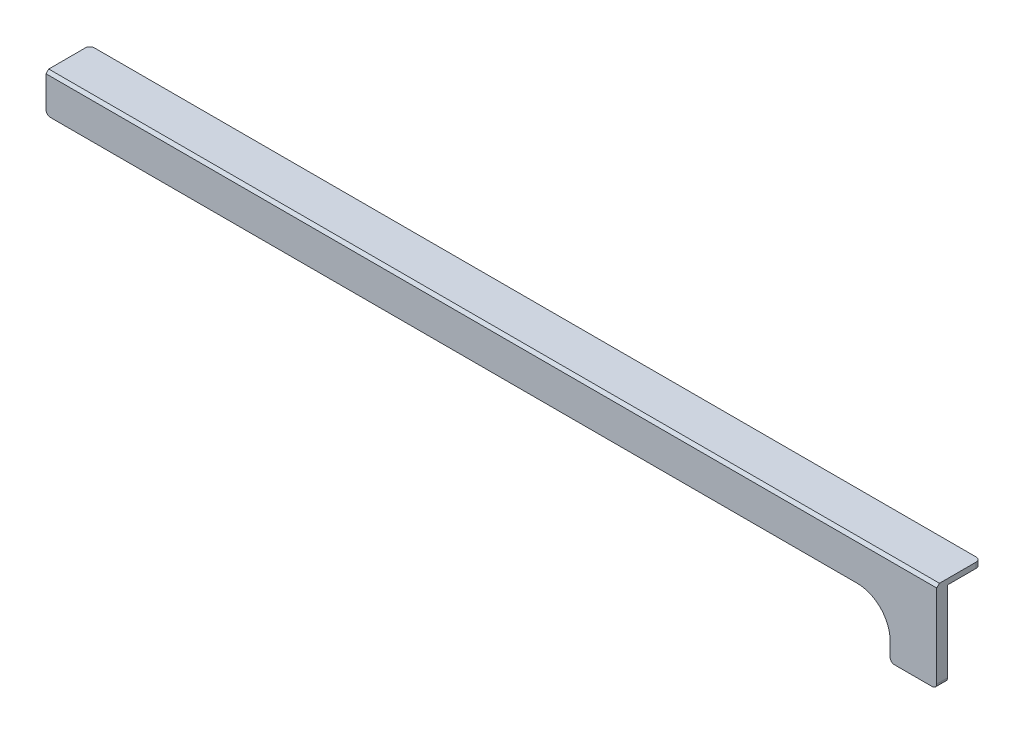
ISO-10303-21;
HEADER;
FILE_DESCRIPTION(('STEP AP214'),'2;1');
FILE_NAME('part.step','',(''),(''),'','','');
FILE_SCHEMA(('AUTOMOTIVE_DESIGN { 1 0 10303 214 1 1 1 1 }'));
ENDSEC;
DATA;
#1=APPLICATION_CONTEXT('core data for automotive mechanical design processes');
#2=APPLICATION_PROTOCOL_DEFINITION('international standard','automotive_design',2000,#1);
#3=PRODUCT_CONTEXT('',#1,'mechanical');
#4=PRODUCT('Part','Part','',(#3));
#5=PRODUCT_RELATED_PRODUCT_CATEGORY('part','',(#4));
#6=PRODUCT_DEFINITION_FORMATION('','',#4);
#7=PRODUCT_DEFINITION_CONTEXT('part definition',#1,'design');
#8=PRODUCT_DEFINITION('design','',#6,#7);
#9=PRODUCT_DEFINITION_SHAPE('','',#8);
#10=(LENGTH_UNIT() NAMED_UNIT(*) SI_UNIT(.MILLI.,.METRE.));
#11=(NAMED_UNIT(*) PLANE_ANGLE_UNIT() SI_UNIT($,.RADIAN.));
#12=(NAMED_UNIT(*) SI_UNIT($,.STERADIAN.) SOLID_ANGLE_UNIT());
#13=UNCERTAINTY_MEASURE_WITH_UNIT(LENGTH_MEASURE(1.E-05),#10,'distance_accuracy_value','');
#14=(GEOMETRIC_REPRESENTATION_CONTEXT(3) GLOBAL_UNCERTAINTY_ASSIGNED_CONTEXT((#13)) GLOBAL_UNIT_ASSIGNED_CONTEXT((#10,
#11,#12)) REPRESENTATION_CONTEXT('',''));
#15=CARTESIAN_POINT('',(0.,0.,0.));
#16=DIRECTION('',(0.,0.,1.));
#17=DIRECTION('',(1.,0.,0.));
#18=AXIS2_PLACEMENT_3D('',#15,#16,#17);
#19=CARTESIAN_POINT('',(0.,0.,10.1038));
#20=DIRECTION('',(0.,0.,-1.));
#21=DIRECTION('',(-1.,0.,0.));
#22=AXIS2_PLACEMENT_3D('',#19,#20,#21);
#23=PLANE('',#22);
#24=CARTESIAN_POINT('',(72.1349700000001,67.1241265,10.1038));
#25=DIRECTION('',(0.,0.,-1.));
#26=DIRECTION('',(-1.,0.,0.));
#27=AXIS2_PLACEMENT_3D('',#24,#25,#26);
#28=CIRCLE('',#27,1.44999999999999);
#29=CARTESIAN_POINT('',(70.6849700000001,67.1241265,10.1038));
#30=VERTEX_POINT('',#29);
#31=EDGE_CURVE('E46',#30,#30,#28,.T.);
#32=ORIENTED_EDGE('',*,*,#31,.F.);
#33=EDGE_LOOP('',(#32));
#34=FACE_BOUND('',#33,.T.);
#35=CARTESIAN_POINT('',(-65.7847699999999,67.1241265,10.1038));
#36=DIRECTION('',(0.,0.,-1.));
#37=DIRECTION('',(-1.,0.,0.));
#38=AXIS2_PLACEMENT_3D('',#35,#36,#37);
#39=CIRCLE('',#38,1.44999999999999);
#40=CARTESIAN_POINT('',(-67.2347699999999,67.1241265,10.1038));
#41=VERTEX_POINT('',#40);
#42=EDGE_CURVE('E181',#41,#41,#39,.T.);
#43=ORIENTED_EDGE('',*,*,#42,.F.);
#44=EDGE_LOOP('',(#43));
#45=FACE_BOUND('',#44,.T.);
#46=CARTESIAN_POINT('',(106.614905,66.623653,10.1038));
#47=DIRECTION('',(0.,0.,-1.));
#48=DIRECTION('',(-1.,0.,0.));
#49=AXIS2_PLACEMENT_3D('',#46,#47,#48);
#50=CIRCLE('',#49,1.25);
#51=CARTESIAN_POINT('',(105.364905,66.623653,10.1038));
#52=VERTEX_POINT('',#51);
#53=EDGE_CURVE('E185',#52,#52,#50,.T.);
#54=ORIENTED_EDGE('',*,*,#53,.F.);
#55=EDGE_LOOP('',(#54));
#56=FACE_BOUND('',#55,.T.);
#57=CARTESIAN_POINT('',(37.6550350000001,66.623653,10.1038));
#58=DIRECTION('',(0.,0.,-1.));
#59=DIRECTION('',(-1.,0.,0.));
#60=AXIS2_PLACEMENT_3D('',#57,#58,#59);
#61=CIRCLE('',#60,1.25);
#62=CARTESIAN_POINT('',(36.4050350000001,66.623653,10.1038));
#63=VERTEX_POINT('',#62);
#64=EDGE_CURVE('E189',#63,#63,#61,.T.);
#65=ORIENTED_EDGE('',*,*,#64,.F.);
#66=EDGE_LOOP('',(#65));
#67=FACE_BOUND('',#66,.T.);
#68=CARTESIAN_POINT('',(-31.3048349999999,66.623653,10.1038));
#69=DIRECTION('',(0.,0.,-1.));
#70=DIRECTION('',(-1.,0.,0.));
#71=AXIS2_PLACEMENT_3D('',#68,#69,#70);
#72=CIRCLE('',#71,1.25);
#73=CARTESIAN_POINT('',(-32.5548349999999,66.623653,10.1038));
#74=VERTEX_POINT('',#73);
#75=EDGE_CURVE('E193',#74,#74,#72,.T.);
#76=ORIENTED_EDGE('',*,*,#75,.F.);
#77=EDGE_LOOP('',(#76));
#78=FACE_BOUND('',#77,.T.);
#79=CARTESIAN_POINT('',(-100.264705,66.623653,10.1038));
#80=DIRECTION('',(0.,0.,-1.));
#81=DIRECTION('',(-1.,0.,0.));
#82=AXIS2_PLACEMENT_3D('',#79,#80,#81);
#83=CIRCLE('',#82,1.25);
#84=CARTESIAN_POINT('',(-101.514705,66.623653,10.1038));
#85=VERTEX_POINT('',#84);
#86=EDGE_CURVE('E197',#85,#85,#83,.T.);
#87=ORIENTED_EDGE('',*,*,#86,.F.);
#88=EDGE_LOOP('',(#87));
#89=FACE_BOUND('',#88,.T.);
#90=DIRECTION('',(0.,1.,0.));
#91=VECTOR('',#90,1.);
#92=CARTESIAN_POINT('',(165.574775,59.6246,10.1038));
#93=LINE('',#92,#91);
#94=CARTESIAN_POINT('',(165.574775,42.2744,10.1038));
#95=VERTEX_POINT('',#94);
#96=CARTESIAN_POINT('',(165.574775,71.6246,10.1038));
#97=VERTEX_POINT('',#96);
#98=EDGE_CURVE('E213',#95,#97,#93,.T.);
#99=ORIENTED_EDGE('',*,*,#98,.F.);
#100=CARTESIAN_POINT('',(163.974775,42.2744,10.1038));
#101=DIRECTION('',(0.,0.,-1.));
#102=DIRECTION('',(-1.,0.,0.));
#103=AXIS2_PLACEMENT_3D('',#100,#101,#102);
#104=CIRCLE('',#103,1.6);
#105=CARTESIAN_POINT('',(163.974775,40.6744,10.1038));
#106=VERTEX_POINT('',#105);
#107=EDGE_CURVE('E274',#95,#106,#104,.T.);
#108=ORIENTED_EDGE('',*,*,#107,.T.);
#109=DIRECTION('',(1.,0.,0.));
#110=VECTOR('',#109,1.);
#111=CARTESIAN_POINT('',(165.574775,40.6744,10.1038));
#112=LINE('',#111,#110);
#113=CARTESIAN_POINT('',(150.175775,40.6744,10.1038));
#114=VERTEX_POINT('',#113);
#115=EDGE_CURVE('E224',#114,#106,#112,.T.);
#116=ORIENTED_EDGE('',*,*,#115,.F.);
#117=CARTESIAN_POINT('',(150.175775,42.2744,10.1038));
#118=DIRECTION('',(0.,0.,-1.));
#119=DIRECTION('',(-1.,0.,0.));
#120=AXIS2_PLACEMENT_3D('',#117,#118,#119);
#121=CIRCLE('',#120,1.6);
#122=CARTESIAN_POINT('',(148.575775,42.2744,10.1038));
#123=VERTEX_POINT('',#122);
#124=EDGE_CURVE('E271',#114,#123,#121,.T.);
#125=ORIENTED_EDGE('',*,*,#124,.T.);
#126=DIRECTION('',(0.,-1.,0.));
#127=VECTOR('',#126,1.);
#128=CARTESIAN_POINT('',(148.575775,40.6744,10.1038));
#129=LINE('',#128,#127);
#130=CARTESIAN_POINT('',(148.575775,47.6246,10.1038));
#131=VERTEX_POINT('',#130);
#132=EDGE_CURVE('E222',#131,#123,#129,.T.);
#133=ORIENTED_EDGE('',*,*,#132,.F.);
#134=CARTESIAN_POINT('',(136.575775,47.6246,10.1038));
#135=DIRECTION('',(0.,0.,-1.));
#136=DIRECTION('',(-1.,0.,0.));
#137=AXIS2_PLACEMENT_3D('',#134,#135,#136);
#138=CIRCLE('',#137,12.);
#139=CARTESIAN_POINT('',(136.575775,59.6246,10.1038));
#140=VERTEX_POINT('',#139);
#141=EDGE_CURVE('E13',#131,#140,#138,.F.);
#142=ORIENTED_EDGE('',*,*,#141,.T.);
#143=DIRECTION('',(1.,0.,0.));
#144=VECTOR('',#143,1.);
#145=CARTESIAN_POINT('',(148.575775,59.6246,10.1038));
#146=LINE('',#145,#144);
#147=CARTESIAN_POINT('',(-157.624575,59.6246,10.1038));
#148=VERTEX_POINT('',#147);
#149=EDGE_CURVE('E219',#148,#140,#146,.T.);
#150=ORIENTED_EDGE('',*,*,#149,.F.);
#151=CARTESIAN_POINT('',(-157.624575,61.2246,10.1038));
#152=DIRECTION('',(0.,0.,-1.));
#153=DIRECTION('',(-1.,0.,0.));
#154=AXIS2_PLACEMENT_3D('',#151,#152,#153);
#155=CIRCLE('',#154,1.6);
#156=CARTESIAN_POINT('',(-159.224575,61.2246,10.1038));
#157=VERTEX_POINT('',#156);
#158=EDGE_CURVE('E269',#148,#157,#155,.T.);
#159=ORIENTED_EDGE('',*,*,#158,.T.);
#160=DIRECTION('',(0.,-1.,0.));
#161=VECTOR('',#160,1.);
#162=CARTESIAN_POINT('',(-159.224575,59.6246,10.1038));
#163=LINE('',#162,#161);
#164=CARTESIAN_POINT('',(-159.224575,71.6246,10.1038));
#165=VERTEX_POINT('',#164);
#166=EDGE_CURVE('E215',#165,#157,#163,.T.);
#167=ORIENTED_EDGE('',*,*,#166,.F.);
#168=DIRECTION('',(1.,0.,0.));
#169=VECTOR('',#168,1.);
#170=CARTESIAN_POINT('',(165.574775,71.6246,10.1038));
#171=LINE('',#170,#169);
#172=EDGE_CURVE('E207',#165,#97,#171,.T.);
#173=ORIENTED_EDGE('',*,*,#172,.T.);
#174=EDGE_LOOP('',(#99,#108,#116,#125,#133,#142,#150,#159,#167,#173));
#175=FACE_BOUND('',#174,.T.);
#176=ADVANCED_FACE('F42',(#34,#45,#56,#67,#78,#89,#175),#23,.T.);
#177=CARTESIAN_POINT('',(165.574775,40.6744,10.1038));
#178=DIRECTION('',(0.,-1.,0.));
#179=DIRECTION('',(0.,0.,-1.));
#180=AXIS2_PLACEMENT_3D('',#177,#178,#179);
#181=PLANE('',#180);
#182=ORIENTED_EDGE('',*,*,#115,.T.);
#183=DIRECTION('',(0.,0.,1.));
#184=VECTOR('',#183,1.);
#185=CARTESIAN_POINT('',(163.974775,40.6744,10.1038));
#186=LINE('',#185,#184);
#187=CARTESIAN_POINT('',(163.974775,40.6744,14.1038));
#188=VERTEX_POINT('',#187);
#189=EDGE_CURVE('E255',#106,#188,#186,.T.);
#190=ORIENTED_EDGE('',*,*,#189,.T.);
#191=DIRECTION('',(1.,0.,0.));
#192=VECTOR('',#191,1.);
#193=CARTESIAN_POINT('',(165.574775,40.6744,14.1038));
#194=LINE('',#193,#192);
#195=CARTESIAN_POINT('',(150.175775,40.6744,14.1038));
#196=VERTEX_POINT('',#195);
#197=EDGE_CURVE('E216',#196,#188,#194,.T.);
#198=ORIENTED_EDGE('',*,*,#197,.F.);
#199=DIRECTION('',(0.,0.,1.));
#200=VECTOR('',#199,1.);
#201=CARTESIAN_POINT('',(150.175775,40.6744,10.1038));
#202=LINE('',#201,#200);
#203=EDGE_CURVE('E253',#196,#114,#202,.F.);
#204=ORIENTED_EDGE('',*,*,#203,.T.);
#205=EDGE_LOOP('',(#182,#190,#198,#204));
#206=FACE_BOUND('',#205,.T.);
#207=ADVANCED_FACE('F318',(#206),#181,.T.);
#208=CARTESIAN_POINT('',(148.575775,40.6744,10.1038));
#209=DIRECTION('',(-1.,0.,0.));
#210=DIRECTION('',(0.,0.,1.));
#211=AXIS2_PLACEMENT_3D('',#208,#209,#210);
#212=PLANE('',#211);
#213=DIRECTION('',(0.,-1.,0.));
#214=VECTOR('',#213,1.);
#215=CARTESIAN_POINT('',(148.575775,40.6744,14.1038));
#216=LINE('',#215,#214);
#217=CARTESIAN_POINT('',(148.575775,47.6246,14.1038));
#218=VERTEX_POINT('',#217);
#219=CARTESIAN_POINT('',(148.575775,42.2744,14.1038));
#220=VERTEX_POINT('',#219);
#221=EDGE_CURVE('E234',#218,#220,#216,.T.);
#222=ORIENTED_EDGE('',*,*,#221,.F.);
#223=DIRECTION('',(0.,0.,1.));
#224=VECTOR('',#223,1.);
#225=CARTESIAN_POINT('',(148.575775,47.6246,10.1038));
#226=LINE('',#225,#224);
#227=EDGE_CURVE('E65',#218,#131,#226,.F.);
#228=ORIENTED_EDGE('',*,*,#227,.T.);
#229=ORIENTED_EDGE('',*,*,#132,.T.);
#230=DIRECTION('',(0.,0.,1.));
#231=VECTOR('',#230,1.);
#232=CARTESIAN_POINT('',(148.575775,42.2744,10.1038));
#233=LINE('',#232,#231);
#234=EDGE_CURVE('E276',#123,#220,#233,.T.);
#235=ORIENTED_EDGE('',*,*,#234,.T.);
#236=EDGE_LOOP('',(#222,#228,#229,#235));
#237=FACE_BOUND('',#236,.T.);
#238=ADVANCED_FACE('F350',(#237),#212,.T.);
#239=CARTESIAN_POINT('',(148.575775,59.6246,10.1038));
#240=DIRECTION('',(0.,-1.,0.));
#241=DIRECTION('',(1.,0.,0.));
#242=AXIS2_PLACEMENT_3D('',#239,#240,#241);
#243=PLANE('',#242);
#244=ORIENTED_EDGE('',*,*,#149,.T.);
#245=DIRECTION('',(0.,0.,1.));
#246=VECTOR('',#245,1.);
#247=CARTESIAN_POINT('',(136.575775,59.6246,14.1038));
#248=LINE('',#247,#246);
#249=CARTESIAN_POINT('',(136.575775,59.6246,14.1038));
#250=VERTEX_POINT('',#249);
#251=EDGE_CURVE('E299',#140,#250,#248,.T.);
#252=ORIENTED_EDGE('',*,*,#251,.T.);
#253=DIRECTION('',(1.,0.,0.));
#254=VECTOR('',#253,1.);
#255=CARTESIAN_POINT('',(148.575775,59.6246,14.1038));
#256=LINE('',#255,#254);
#257=CARTESIAN_POINT('',(-157.624575,59.6246,14.1038));
#258=VERTEX_POINT('',#257);
#259=EDGE_CURVE('E232',#258,#250,#256,.T.);
#260=ORIENTED_EDGE('',*,*,#259,.F.);
#261=DIRECTION('',(0.,0.,1.));
#262=VECTOR('',#261,1.);
#263=CARTESIAN_POINT('',(-157.624575,59.6246,10.1038));
#264=LINE('',#263,#262);
#265=EDGE_CURVE('E284',#258,#148,#264,.F.);
#266=ORIENTED_EDGE('',*,*,#265,.T.);
#267=EDGE_LOOP('',(#244,#252,#260,#266));
#268=FACE_BOUND('',#267,.T.);
#269=ADVANCED_FACE('F357',(#268),#243,.T.);
#270=CARTESIAN_POINT('',(-159.224575,59.6246,10.1038));
#271=DIRECTION('',(-1.,0.,0.));
#272=DIRECTION('',(0.,0.,1.));
#273=AXIS2_PLACEMENT_3D('',#270,#271,#272);
#274=PLANE('',#273);
#275=ORIENTED_EDGE('',*,*,#166,.T.);
#276=DIRECTION('',(0.,0.,1.));
#277=VECTOR('',#276,1.);
#278=CARTESIAN_POINT('',(-159.224575,61.2246,10.1038));
#279=LINE('',#278,#277);
#280=CARTESIAN_POINT('',(-159.224575,61.2246,14.1038));
#281=VERTEX_POINT('',#280);
#282=EDGE_CURVE('E281',#157,#281,#279,.T.);
#283=ORIENTED_EDGE('',*,*,#282,.T.);
#284=DIRECTION('',(0.,-1.,0.));
#285=VECTOR('',#284,1.);
#286=CARTESIAN_POINT('',(-159.224575,59.6246,14.1038));
#287=LINE('',#286,#285);
#288=CARTESIAN_POINT('',(-159.224575,72.6246,14.1038));
#289=VERTEX_POINT('',#288);
#290=EDGE_CURVE('E229',#289,#281,#287,.T.);
#291=ORIENTED_EDGE('',*,*,#290,.F.);
#292=DIRECTION('',(0.,0.707106781186548,-0.707106781186548));
#293=VECTOR('',#292,1.);
#294=CARTESIAN_POINT('',(-159.224575,68.1246,18.6038));
#295=LINE('',#294,#293);
#296=CARTESIAN_POINT('',(-159.224575,73.6246,13.1038));
#297=VERTEX_POINT('',#296);
#298=EDGE_CURVE('E244',#289,#297,#295,.T.);
#299=ORIENTED_EDGE('',*,*,#298,.T.);
#300=DIRECTION('',(0.,0.,1.));
#301=VECTOR('',#300,1.);
#302=CARTESIAN_POINT('',(-159.224575,73.6246,10.1038));
#303=LINE('',#302,#301);
#304=CARTESIAN_POINT('',(-159.224575,73.6246,-0.2962));
#305=VERTEX_POINT('',#304);
#306=EDGE_CURVE('E238',#305,#297,#303,.T.);
#307=ORIENTED_EDGE('',*,*,#306,.F.);
#308=DIRECTION('',(0.,1.,0.));
#309=VECTOR('',#308,1.);
#310=CARTESIAN_POINT('',(-159.224575,59.6246,-0.2962));
#311=LINE('',#310,#309);
#312=CARTESIAN_POINT('',(-159.224575,71.6246,-0.2962));
#313=VERTEX_POINT('',#312);
#314=EDGE_CURVE('E279',#305,#313,#311,.F.);
#315=ORIENTED_EDGE('',*,*,#314,.T.);
#316=DIRECTION('',(0.,0.,1.));
#317=VECTOR('',#316,1.);
#318=CARTESIAN_POINT('',(-159.224575,71.6246,10.1038));
#319=LINE('',#318,#317);
#320=EDGE_CURVE('E205',#313,#165,#319,.T.);
#321=ORIENTED_EDGE('',*,*,#320,.T.);
#322=EDGE_LOOP('',(#275,#283,#291,#299,#307,#315,#321));
#323=FACE_BOUND('',#322,.T.);
#324=ADVANCED_FACE('F365',(#323),#274,.T.);
#325=CARTESIAN_POINT('',(-159.224575,73.6246,10.1038));
#326=DIRECTION('',(0.,1.,0.));
#327=DIRECTION('',(0.,0.,1.));
#328=AXIS2_PLACEMENT_3D('',#325,#326,#327);
#329=PLANE('',#328);
#330=DIRECTION('',(-1.,0.,0.));
#331=VECTOR('',#330,1.);
#332=CARTESIAN_POINT('',(-159.224575,73.6246,-1.8962));
#333=LINE('',#332,#331);
#334=CARTESIAN_POINT('',(163.974775,73.6246,-1.8962));
#335=VERTEX_POINT('',#334);
#336=CARTESIAN_POINT('',(-157.624575,73.6246,-1.8962));
#337=VERTEX_POINT('',#336);
#338=EDGE_CURVE('E202',#335,#337,#333,.T.);
#339=ORIENTED_EDGE('',*,*,#338,.T.);
#340=CARTESIAN_POINT('',(-157.624575,73.6246,-0.296200000000001));
#341=DIRECTION('',(0.,1.,0.));
#342=DIRECTION('',(0.,0.,1.));
#343=AXIS2_PLACEMENT_3D('',#340,#341,#342);
#344=CIRCLE('',#343,1.6);
#345=EDGE_CURVE('E293',#337,#305,#344,.T.);
#346=ORIENTED_EDGE('',*,*,#345,.T.);
#347=ORIENTED_EDGE('',*,*,#306,.T.);
#348=DIRECTION('',(1.,0.,0.));
#349=VECTOR('',#348,1.);
#350=CARTESIAN_POINT('',(165.574775,73.6246,13.1038));
#351=LINE('',#350,#349);
#352=CARTESIAN_POINT('',(165.574775,73.6246,13.1038));
#353=VERTEX_POINT('',#352);
#354=EDGE_CURVE('E247',#297,#353,#351,.T.);
#355=ORIENTED_EDGE('',*,*,#354,.T.);
#356=DIRECTION('',(0.,0.,1.));
#357=VECTOR('',#356,1.);
#358=CARTESIAN_POINT('',(165.574775,73.6246,10.1038));
#359=LINE('',#358,#357);
#360=CARTESIAN_POINT('',(165.574775,73.6246,-0.2962));
#361=VERTEX_POINT('',#360);
#362=EDGE_CURVE('E227',#361,#353,#359,.T.);
#363=ORIENTED_EDGE('',*,*,#362,.F.);
#364=CARTESIAN_POINT('',(163.974775,73.6246,-0.2962));
#365=DIRECTION('',(0.,1.,0.));
#366=DIRECTION('',(0.,0.,1.));
#367=AXIS2_PLACEMENT_3D('',#364,#365,#366);
#368=CIRCLE('',#367,1.6);
#369=EDGE_CURVE('E291',#361,#335,#368,.T.);
#370=ORIENTED_EDGE('',*,*,#369,.T.);
#371=EDGE_LOOP('',(#339,#346,#347,#355,#363,#370));
#372=FACE_BOUND('',#371,.T.);
#373=ADVANCED_FACE('F382',(#372),#329,.T.);
#374=CARTESIAN_POINT('',(165.574775,73.6246,10.1038));
#375=DIRECTION('',(1.,0.,0.));
#376=DIRECTION('',(0.,1.,0.));
#377=AXIS2_PLACEMENT_3D('',#374,#375,#376);
#378=PLANE('',#377);
#379=DIRECTION('',(0.,1.,0.));
#380=VECTOR('',#379,1.);
#381=CARTESIAN_POINT('',(165.574775,73.6246,14.1038));
#382=LINE('',#381,#380);
#383=CARTESIAN_POINT('',(165.574775,42.2744,14.1038));
#384=VERTEX_POINT('',#383);
#385=CARTESIAN_POINT('',(165.574775,72.6246,14.1038));
#386=VERTEX_POINT('',#385);
#387=EDGE_CURVE('E210',#384,#386,#382,.T.);
#388=ORIENTED_EDGE('',*,*,#387,.F.);
#389=DIRECTION('',(0.,0.,1.));
#390=VECTOR('',#389,1.);
#391=CARTESIAN_POINT('',(165.574775,42.2744,10.1038));
#392=LINE('',#391,#390);
#393=EDGE_CURVE('E267',#384,#95,#392,.F.);
#394=ORIENTED_EDGE('',*,*,#393,.T.);
#395=ORIENTED_EDGE('',*,*,#98,.T.);
#396=DIRECTION('',(0.,0.,-1.));
#397=VECTOR('',#396,1.);
#398=CARTESIAN_POINT('',(165.574775,71.6246,-1.8962));
#399=LINE('',#398,#397);
#400=CARTESIAN_POINT('',(165.574775,71.6246,-0.2962));
#401=VERTEX_POINT('',#400);
#402=EDGE_CURVE('E198',#97,#401,#399,.T.);
#403=ORIENTED_EDGE('',*,*,#402,.T.);
#404=DIRECTION('',(0.,1.,0.));
#405=VECTOR('',#404,1.);
#406=CARTESIAN_POINT('',(165.574775,73.6246,-0.2962));
#407=LINE('',#406,#405);
#408=EDGE_CURVE('E264',#401,#361,#407,.T.);
#409=ORIENTED_EDGE('',*,*,#408,.T.);
#410=ORIENTED_EDGE('',*,*,#362,.T.);
#411=DIRECTION('',(0.,-0.707106781186548,0.707106781186548));
#412=VECTOR('',#411,1.);
#413=CARTESIAN_POINT('',(165.574775,75.1246,11.6038));
#414=LINE('',#413,#412);
#415=EDGE_CURVE('E250',#353,#386,#414,.T.);
#416=ORIENTED_EDGE('',*,*,#415,.T.);
#417=EDGE_LOOP('',(#388,#394,#395,#403,#409,#410,#416));
#418=FACE_BOUND('',#417,.T.);
#419=ADVANCED_FACE('F375',(#418),#378,.T.);
#420=CARTESIAN_POINT('',(0.,0.,14.1038));
#421=DIRECTION('',(0.,0.,-1.));
#422=DIRECTION('',(-1.,0.,0.));
#423=AXIS2_PLACEMENT_3D('',#420,#421,#422);
#424=PLANE('',#423);
#425=ORIENTED_EDGE('',*,*,#197,.T.);
#426=CARTESIAN_POINT('',(163.974775,42.2744,14.1038));
#427=DIRECTION('',(0.,0.,-1.));
#428=DIRECTION('',(-1.,0.,0.));
#429=AXIS2_PLACEMENT_3D('',#426,#427,#428);
#430=CIRCLE('',#429,1.6);
#431=EDGE_CURVE('E262',#188,#384,#430,.F.);
#432=ORIENTED_EDGE('',*,*,#431,.T.);
#433=ORIENTED_EDGE('',*,*,#387,.T.);
#434=DIRECTION('',(-1.,0.,0.));
#435=VECTOR('',#434,1.);
#436=CARTESIAN_POINT('',(-159.224575,72.6246,14.1038));
#437=LINE('',#436,#435);
#438=EDGE_CURVE('E240',#386,#289,#437,.T.);
#439=ORIENTED_EDGE('',*,*,#438,.T.);
#440=ORIENTED_EDGE('',*,*,#290,.T.);
#441=CARTESIAN_POINT('',(-157.624575,61.2246,14.1038));
#442=DIRECTION('',(0.,0.,-1.));
#443=DIRECTION('',(-1.,0.,0.));
#444=AXIS2_PLACEMENT_3D('',#441,#442,#443);
#445=CIRCLE('',#444,1.6);
#446=EDGE_CURVE('E258',#281,#258,#445,.F.);
#447=ORIENTED_EDGE('',*,*,#446,.T.);
#448=ORIENTED_EDGE('',*,*,#259,.T.);
#449=CARTESIAN_POINT('',(136.575775,47.6246,14.1038));
#450=DIRECTION('',(0.,0.,-1.));
#451=DIRECTION('',(-1.,0.,0.));
#452=AXIS2_PLACEMENT_3D('',#449,#450,#451);
#453=CIRCLE('',#452,12.);
#454=EDGE_CURVE('E51',#250,#218,#453,.T.);
#455=ORIENTED_EDGE('',*,*,#454,.T.);
#456=ORIENTED_EDGE('',*,*,#221,.T.);
#457=CARTESIAN_POINT('',(150.175775,42.2744,14.1038));
#458=DIRECTION('',(0.,0.,-1.));
#459=DIRECTION('',(-1.,0.,0.));
#460=AXIS2_PLACEMENT_3D('',#457,#458,#459);
#461=CIRCLE('',#460,1.6);
#462=EDGE_CURVE('E260',#220,#196,#461,.F.);
#463=ORIENTED_EDGE('',*,*,#462,.T.);
#464=EDGE_LOOP('',(#425,#432,#433,#439,#440,#447,#448,#455,#456,#463));
#465=FACE_BOUND('',#464,.T.);
#466=ADVANCED_FACE('F343',(#465),#424,.F.);
#467=CARTESIAN_POINT('',(-159.224575,71.6246,-1.8962));
#468=DIRECTION('',(0.,0.,-1.));
#469=DIRECTION('',(-1.,0.,0.));
#470=AXIS2_PLACEMENT_3D('',#467,#468,#469);
#471=PLANE('',#470);
#472=DIRECTION('',(-1.,0.,0.));
#473=VECTOR('',#472,1.);
#474=CARTESIAN_POINT('',(-159.224575,71.6246,-1.8962));
#475=LINE('',#474,#473);
#476=CARTESIAN_POINT('',(163.974775,71.6246,-1.8962));
#477=VERTEX_POINT('',#476);
#478=CARTESIAN_POINT('',(-157.624575,71.6246,-1.8962));
#479=VERTEX_POINT('',#478);
#480=EDGE_CURVE('E201',#477,#479,#475,.T.);
#481=ORIENTED_EDGE('',*,*,#480,.T.);
#482=DIRECTION('',(0.,1.,0.));
#483=VECTOR('',#482,1.);
#484=CARTESIAN_POINT('',(-157.624575,71.6246,-1.8962));
#485=LINE('',#484,#483);
#486=EDGE_CURVE('E288',#479,#337,#485,.T.);
#487=ORIENTED_EDGE('',*,*,#486,.T.);
#488=ORIENTED_EDGE('',*,*,#338,.F.);
#489=DIRECTION('',(0.,1.,0.));
#490=VECTOR('',#489,1.);
#491=CARTESIAN_POINT('',(163.974775,71.6246000000007,-1.8962));
#492=LINE('',#491,#490);
#493=EDGE_CURVE('E286',#335,#477,#492,.F.);
#494=ORIENTED_EDGE('',*,*,#493,.T.);
#495=EDGE_LOOP('',(#481,#487,#488,#494));
#496=FACE_BOUND('',#495,.T.);
#497=ADVANCED_FACE('F384',(#496),#471,.T.);
#498=CARTESIAN_POINT('',(0.,71.6246,0.));
#499=DIRECTION('',(0.,-1.,0.));
#500=DIRECTION('',(0.,0.,-1.));
#501=AXIS2_PLACEMENT_3D('',#498,#499,#500);
#502=PLANE('',#501);
#503=ORIENTED_EDGE('',*,*,#320,.F.);
#504=CARTESIAN_POINT('',(-157.624575,71.6246,-0.296200000000001));
#505=DIRECTION('',(0.,-1.,0.));
#506=DIRECTION('',(0.,0.,-1.));
#507=AXIS2_PLACEMENT_3D('',#504,#505,#506);
#508=CIRCLE('',#507,1.6);
#509=EDGE_CURVE('E297',#313,#479,#508,.T.);
#510=ORIENTED_EDGE('',*,*,#509,.T.);
#511=ORIENTED_EDGE('',*,*,#480,.F.);
#512=CARTESIAN_POINT('',(163.974775,71.6246,-0.2962));
#513=DIRECTION('',(0.,-1.,0.));
#514=DIRECTION('',(0.,0.,-1.));
#515=AXIS2_PLACEMENT_3D('',#512,#513,#514);
#516=CIRCLE('',#515,1.6);
#517=EDGE_CURVE('E295',#477,#401,#516,.T.);
#518=ORIENTED_EDGE('',*,*,#517,.T.);
#519=ORIENTED_EDGE('',*,*,#402,.F.);
#520=ORIENTED_EDGE('',*,*,#172,.F.);
#521=EDGE_LOOP('',(#503,#510,#511,#518,#519,#520));
#522=FACE_BOUND('',#521,.T.);
#523=ADVANCED_FACE('F371',(#522),#502,.T.);
#524=CARTESIAN_POINT('',(0.,72.6246,14.1038));
#525=DIRECTION('',(0.,0.707106781186547,0.707106781186547));
#526=DIRECTION('',(1.,0.,0.));
#527=AXIS2_PLACEMENT_3D('',#524,#525,#526);
#528=PLANE('',#527);
#529=ORIENTED_EDGE('',*,*,#415,.F.);
#530=ORIENTED_EDGE('',*,*,#354,.F.);
#531=ORIENTED_EDGE('',*,*,#298,.F.);
#532=ORIENTED_EDGE('',*,*,#438,.F.);
#533=EDGE_LOOP('',(#529,#530,#531,#532));
#534=FACE_BOUND('',#533,.T.);
#535=ADVANCED_FACE('F392',(#534),#528,.T.);
#536=CARTESIAN_POINT('',(163.974775,42.2744,10.1038));
#537=DIRECTION('',(0.,0.,1.));
#538=DIRECTION('',(1.,0.,0.));
#539=AXIS2_PLACEMENT_3D('',#536,#537,#538);
#540=CYLINDRICAL_SURFACE('',#539,1.6);
#541=ORIENTED_EDGE('',*,*,#107,.F.);
#542=ORIENTED_EDGE('',*,*,#393,.F.);
#543=ORIENTED_EDGE('',*,*,#431,.F.);
#544=ORIENTED_EDGE('',*,*,#189,.F.);
#545=EDGE_LOOP('',(#541,#542,#543,#544));
#546=FACE_BOUND('',#545,.T.);
#547=ADVANCED_FACE('F339',(#546),#540,.T.);
#548=CARTESIAN_POINT('',(150.175775,42.2744,10.1038));
#549=DIRECTION('',(0.,0.,1.));
#550=DIRECTION('',(1.,0.,0.));
#551=AXIS2_PLACEMENT_3D('',#548,#549,#550);
#552=CYLINDRICAL_SURFACE('',#551,1.6);
#553=ORIENTED_EDGE('',*,*,#124,.F.);
#554=ORIENTED_EDGE('',*,*,#203,.F.);
#555=ORIENTED_EDGE('',*,*,#462,.F.);
#556=ORIENTED_EDGE('',*,*,#234,.F.);
#557=EDGE_LOOP('',(#553,#554,#555,#556));
#558=FACE_BOUND('',#557,.T.);
#559=ADVANCED_FACE('F349',(#558),#552,.T.);
#560=CARTESIAN_POINT('',(-157.624575,61.2246,10.1038));
#561=DIRECTION('',(0.,0.,1.));
#562=DIRECTION('',(1.,0.,0.));
#563=AXIS2_PLACEMENT_3D('',#560,#561,#562);
#564=CYLINDRICAL_SURFACE('',#563,1.6);
#565=ORIENTED_EDGE('',*,*,#158,.F.);
#566=ORIENTED_EDGE('',*,*,#265,.F.);
#567=ORIENTED_EDGE('',*,*,#446,.F.);
#568=ORIENTED_EDGE('',*,*,#282,.F.);
#569=EDGE_LOOP('',(#565,#566,#567,#568));
#570=FACE_BOUND('',#569,.T.);
#571=ADVANCED_FACE('F363',(#570),#564,.T.);
#572=CARTESIAN_POINT('',(-157.624575,71.6246,-0.296200000000001));
#573=DIRECTION('',(0.,1.,0.));
#574=DIRECTION('',(0.,0.,1.));
#575=AXIS2_PLACEMENT_3D('',#572,#573,#574);
#576=CYLINDRICAL_SURFACE('',#575,1.6);
#577=ORIENTED_EDGE('',*,*,#509,.F.);
#578=ORIENTED_EDGE('',*,*,#314,.F.);
#579=ORIENTED_EDGE('',*,*,#345,.F.);
#580=ORIENTED_EDGE('',*,*,#486,.F.);
#581=EDGE_LOOP('',(#577,#578,#579,#580));
#582=FACE_BOUND('',#581,.T.);
#583=ADVANCED_FACE('F387',(#582),#576,.T.);
#584=CARTESIAN_POINT('',(163.974775,73.6246,-0.2962));
#585=DIRECTION('',(0.,1.,0.));
#586=DIRECTION('',(-1.,0.,0.));
#587=AXIS2_PLACEMENT_3D('',#584,#585,#586);
#588=CYLINDRICAL_SURFACE('',#587,1.6);
#589=ORIENTED_EDGE('',*,*,#517,.F.);
#590=ORIENTED_EDGE('',*,*,#493,.F.);
#591=ORIENTED_EDGE('',*,*,#369,.F.);
#592=ORIENTED_EDGE('',*,*,#408,.F.);
#593=EDGE_LOOP('',(#589,#590,#591,#592));
#594=FACE_BOUND('',#593,.T.);
#595=ADVANCED_FACE('F378',(#594),#588,.T.);
#596=CARTESIAN_POINT('',(136.575775,47.6246,10.1038));
#597=DIRECTION('',(0.,0.,-1.));
#598=DIRECTION('',(-1.,0.,0.));
#599=AXIS2_PLACEMENT_3D('',#596,#597,#598);
#600=CYLINDRICAL_SURFACE('',#599,12.);
#601=ORIENTED_EDGE('',*,*,#141,.F.);
#602=ORIENTED_EDGE('',*,*,#227,.F.);
#603=ORIENTED_EDGE('',*,*,#454,.F.);
#604=ORIENTED_EDGE('',*,*,#251,.F.);
#605=EDGE_LOOP('',(#601,#602,#603,#604));
#606=FACE_BOUND('',#605,.T.);
#607=ADVANCED_FACE('F44',(#606),#600,.F.);
#608=CARTESIAN_POINT('',(-100.264705,66.623653,12.0798));
#609=DIRECTION('',(0.,0.,-1.));
#610=DIRECTION('',(-1.,0.,0.));
#611=AXIS2_PLACEMENT_3D('',#608,#609,#610);
#612=CONICAL_SURFACE('',#611,1.25,1.02974425867666);
#613=CARTESIAN_POINT('',(-100.264705,66.623653,12.8308757737845));
#614=VERTEX_POINT('',#613);
#615=VERTEX_LOOP('',#614);
#616=FACE_BOUND('',#615,.T.);
#617=CARTESIAN_POINT('',(-100.264705,66.623653,12.0798));
#618=DIRECTION('',(0.,0.,-1.));
#619=DIRECTION('',(-1.,0.,0.));
#620=AXIS2_PLACEMENT_3D('',#617,#618,#619);
#621=CIRCLE('',#620,1.25);
#622=CARTESIAN_POINT('',(-101.514705,66.623653,12.0798));
#623=VERTEX_POINT('',#622);
#624=EDGE_CURVE('E194',#623,#623,#621,.T.);
#625=ORIENTED_EDGE('',*,*,#624,.T.);
#626=EDGE_LOOP('',(#625));
#627=FACE_BOUND('',#626,.T.);
#628=ADVANCED_FACE('F416',(#616,#627),#612,.F.);
#629=CARTESIAN_POINT('',(-100.264705,66.623653,5.0798));
#630=DIRECTION('',(0.,0.,-1.));
#631=DIRECTION('',(-1.,0.,0.));
#632=AXIS2_PLACEMENT_3D('',#629,#630,#631);
#633=CYLINDRICAL_SURFACE('',#632,1.25);
#634=ORIENTED_EDGE('',*,*,#86,.T.);
#635=EDGE_LOOP('',(#634));
#636=FACE_BOUND('',#635,.T.);
#637=ORIENTED_EDGE('',*,*,#624,.F.);
#638=EDGE_LOOP('',(#637));
#639=FACE_BOUND('',#638,.T.);
#640=ADVANCED_FACE('F420',(#636,#639),#633,.F.);
#641=CARTESIAN_POINT('',(-31.3048349999999,66.623653,12.0798));
#642=DIRECTION('',(0.,0.,-1.));
#643=DIRECTION('',(-1.,0.,0.));
#644=AXIS2_PLACEMENT_3D('',#641,#642,#643);
#645=CONICAL_SURFACE('',#644,1.25,1.02974425867665);
#646=CARTESIAN_POINT('',(-31.3048349999999,66.623653,12.8308757737845));
#647=VERTEX_POINT('',#646);
#648=VERTEX_LOOP('',#647);
#649=FACE_BOUND('',#648,.T.);
#650=CARTESIAN_POINT('',(-31.3048349999999,66.623653,12.0798));
#651=DIRECTION('',(0.,0.,-1.));
#652=DIRECTION('',(-1.,0.,0.));
#653=AXIS2_PLACEMENT_3D('',#650,#651,#652);
#654=CIRCLE('',#653,1.25);
#655=CARTESIAN_POINT('',(-32.5548349999999,66.623653,12.0798));
#656=VERTEX_POINT('',#655);
#657=EDGE_CURVE('E190',#656,#656,#654,.T.);
#658=ORIENTED_EDGE('',*,*,#657,.T.);
#659=EDGE_LOOP('',(#658));
#660=FACE_BOUND('',#659,.T.);
#661=ADVANCED_FACE('F426',(#649,#660),#645,.F.);
#662=CARTESIAN_POINT('',(-31.3048349999999,66.623653,5.0798));
#663=DIRECTION('',(0.,0.,-1.));
#664=DIRECTION('',(-1.,0.,0.));
#665=AXIS2_PLACEMENT_3D('',#662,#663,#664);
#666=CYLINDRICAL_SURFACE('',#665,1.25);
#667=ORIENTED_EDGE('',*,*,#75,.T.);
#668=EDGE_LOOP('',(#667));
#669=FACE_BOUND('',#668,.T.);
#670=ORIENTED_EDGE('',*,*,#657,.F.);
#671=EDGE_LOOP('',(#670));
#672=FACE_BOUND('',#671,.T.);
#673=ADVANCED_FACE('F595',(#669,#672),#666,.F.);
#674=CARTESIAN_POINT('',(37.6550350000001,66.623653,12.0798));
#675=DIRECTION('',(0.,0.,-1.));
#676=DIRECTION('',(-1.,0.,0.));
#677=AXIS2_PLACEMENT_3D('',#674,#675,#676);
#678=CONICAL_SURFACE('',#677,1.25,1.02974425867666);
#679=CARTESIAN_POINT('',(37.6550350000001,66.623653,12.8308757737845));
#680=VERTEX_POINT('',#679);
#681=VERTEX_LOOP('',#680);
#682=FACE_BOUND('',#681,.T.);
#683=CARTESIAN_POINT('',(37.6550350000001,66.623653,12.0798));
#684=DIRECTION('',(0.,0.,-1.));
#685=DIRECTION('',(-1.,0.,0.));
#686=AXIS2_PLACEMENT_3D('',#683,#684,#685);
#687=CIRCLE('',#686,1.25);
#688=CARTESIAN_POINT('',(36.4050350000001,66.623653,12.0798));
#689=VERTEX_POINT('',#688);
#690=EDGE_CURVE('E186',#689,#689,#687,.T.);
#691=ORIENTED_EDGE('',*,*,#690,.T.);
#692=EDGE_LOOP('',(#691));
#693=FACE_BOUND('',#692,.T.);
#694=ADVANCED_FACE('F591',(#682,#693),#678,.F.);
#695=CARTESIAN_POINT('',(37.6550350000001,66.623653,5.0798));
#696=DIRECTION('',(0.,0.,-1.));
#697=DIRECTION('',(-1.,0.,0.));
#698=AXIS2_PLACEMENT_3D('',#695,#696,#697);
#699=CYLINDRICAL_SURFACE('',#698,1.25);
#700=ORIENTED_EDGE('',*,*,#64,.T.);
#701=EDGE_LOOP('',(#700));
#702=FACE_BOUND('',#701,.T.);
#703=ORIENTED_EDGE('',*,*,#690,.F.);
#704=EDGE_LOOP('',(#703));
#705=FACE_BOUND('',#704,.T.);
#706=ADVANCED_FACE('F587',(#702,#705),#699,.F.);
#707=CARTESIAN_POINT('',(106.614905,66.623653,12.0798));
#708=DIRECTION('',(0.,0.,-1.));
#709=DIRECTION('',(-1.,0.,0.));
#710=AXIS2_PLACEMENT_3D('',#707,#708,#709);
#711=CONICAL_SURFACE('',#710,1.25,1.02974425867666);
#712=CARTESIAN_POINT('',(106.614905,66.623653,12.8308757737845));
#713=VERTEX_POINT('',#712);
#714=VERTEX_LOOP('',#713);
#715=FACE_BOUND('',#714,.T.);
#716=CARTESIAN_POINT('',(106.614905,66.623653,12.0798));
#717=DIRECTION('',(0.,0.,-1.));
#718=DIRECTION('',(-1.,0.,0.));
#719=AXIS2_PLACEMENT_3D('',#716,#717,#718);
#720=CIRCLE('',#719,1.25);
#721=CARTESIAN_POINT('',(105.364905,66.623653,12.0798));
#722=VERTEX_POINT('',#721);
#723=EDGE_CURVE('E182',#722,#722,#720,.T.);
#724=ORIENTED_EDGE('',*,*,#723,.T.);
#725=EDGE_LOOP('',(#724));
#726=FACE_BOUND('',#725,.T.);
#727=ADVANCED_FACE('F583',(#715,#726),#711,.F.);
#728=CARTESIAN_POINT('',(106.614905,66.623653,5.0798));
#729=DIRECTION('',(0.,0.,-1.));
#730=DIRECTION('',(-1.,0.,0.));
#731=AXIS2_PLACEMENT_3D('',#728,#729,#730);
#732=CYLINDRICAL_SURFACE('',#731,1.25);
#733=ORIENTED_EDGE('',*,*,#53,.T.);
#734=EDGE_LOOP('',(#733));
#735=FACE_BOUND('',#734,.T.);
#736=ORIENTED_EDGE('',*,*,#723,.F.);
#737=EDGE_LOOP('',(#736));
#738=FACE_BOUND('',#737,.T.);
#739=ADVANCED_FACE('F544',(#735,#738),#732,.F.);
#740=CARTESIAN_POINT('',(-65.7847699999999,67.1241265,12.));
#741=DIRECTION('',(0.,0.,-1.));
#742=DIRECTION('',(-1.,0.,0.));
#743=AXIS2_PLACEMENT_3D('',#740,#741,#742);
#744=CONICAL_SURFACE('',#743,1.44999999999999,1.02974425867665);
#745=CARTESIAN_POINT('',(-65.7847699999999,67.1241265,12.87124789759));
#746=VERTEX_POINT('',#745);
#747=VERTEX_LOOP('',#746);
#748=FACE_BOUND('',#747,.T.);
#749=CARTESIAN_POINT('',(-65.7847699999999,67.1241265,12.));
#750=DIRECTION('',(0.,0.,-1.));
#751=DIRECTION('',(-1.,0.,0.));
#752=AXIS2_PLACEMENT_3D('',#749,#750,#751);
#753=CIRCLE('',#752,1.44999999999999);
#754=CARTESIAN_POINT('',(-67.2347699999999,67.1241265,12.));
#755=VERTEX_POINT('',#754);
#756=EDGE_CURVE('E177',#755,#755,#753,.T.);
#757=ORIENTED_EDGE('',*,*,#756,.T.);
#758=EDGE_LOOP('',(#757));
#759=FACE_BOUND('',#758,.T.);
#760=ADVANCED_FACE('F549',(#748,#759),#744,.F.);
#761=CARTESIAN_POINT('',(-65.7847699999999,67.1241265,-6.));
#762=DIRECTION('',(0.,0.,-1.));
#763=DIRECTION('',(-1.,0.,0.));
#764=AXIS2_PLACEMENT_3D('',#761,#762,#763);
#765=CYLINDRICAL_SURFACE('',#764,1.44999999999999);
#766=ORIENTED_EDGE('',*,*,#42,.T.);
#767=EDGE_LOOP('',(#766));
#768=FACE_BOUND('',#767,.T.);
#769=ORIENTED_EDGE('',*,*,#756,.F.);
#770=EDGE_LOOP('',(#769));
#771=FACE_BOUND('',#770,.T.);
#772=ADVANCED_FACE('F169',(#768,#771),#765,.F.);
#773=CARTESIAN_POINT('',(72.1349700000001,67.1241265,12.));
#774=DIRECTION('',(0.,0.,-1.));
#775=DIRECTION('',(-1.,0.,0.));
#776=AXIS2_PLACEMENT_3D('',#773,#774,#775);
#777=CONICAL_SURFACE('',#776,1.44999999999999,1.02974425867665);
#778=CARTESIAN_POINT('',(72.1349700000001,67.1241265,12.87124789759));
#779=VERTEX_POINT('',#778);
#780=VERTEX_LOOP('',#779);
#781=FACE_BOUND('',#780,.T.);
#782=CARTESIAN_POINT('',(72.1349700000001,67.1241265,12.));
#783=DIRECTION('',(0.,0.,-1.));
#784=DIRECTION('',(-1.,0.,0.));
#785=AXIS2_PLACEMENT_3D('',#782,#783,#784);
#786=CIRCLE('',#785,1.44999999999999);
#787=CARTESIAN_POINT('',(70.6849700000001,67.1241265,12.));
#788=VERTEX_POINT('',#787);
#789=EDGE_CURVE('E173',#788,#788,#786,.T.);
#790=ORIENTED_EDGE('',*,*,#789,.T.);
#791=EDGE_LOOP('',(#790));
#792=FACE_BOUND('',#791,.T.);
#793=ADVANCED_FACE('F165',(#781,#792),#777,.F.);
#794=CARTESIAN_POINT('',(72.1349700000001,67.1241265,-6.));
#795=DIRECTION('',(0.,0.,-1.));
#796=DIRECTION('',(-1.,0.,0.));
#797=AXIS2_PLACEMENT_3D('',#794,#795,#796);
#798=CYLINDRICAL_SURFACE('',#797,1.44999999999999);
#799=ORIENTED_EDGE('',*,*,#31,.T.);
#800=EDGE_LOOP('',(#799));
#801=FACE_BOUND('',#800,.T.);
#802=ORIENTED_EDGE('',*,*,#789,.F.);
#803=EDGE_LOOP('',(#802));
#804=FACE_BOUND('',#803,.T.);
#805=ADVANCED_FACE('F168',(#801,#804),#798,.F.);
#806=CLOSED_SHELL('',(#176,#207,#238,#269,#324,#373,#419,#466,#497,#523,#535,#547,#559,#571,
#583,#595,#607,#628,#640,#661,#673,#694,#706,#727,#739,#760,#772,#793,#805));
#807=MANIFOLD_SOLID_BREP('B2',#806);
#808=ADVANCED_BREP_SHAPE_REPRESENTATION('',(#18,#807),#14);
#809=SHAPE_DEFINITION_REPRESENTATION(#9,#808);
ENDSEC;
END-ISO-10303-21;
